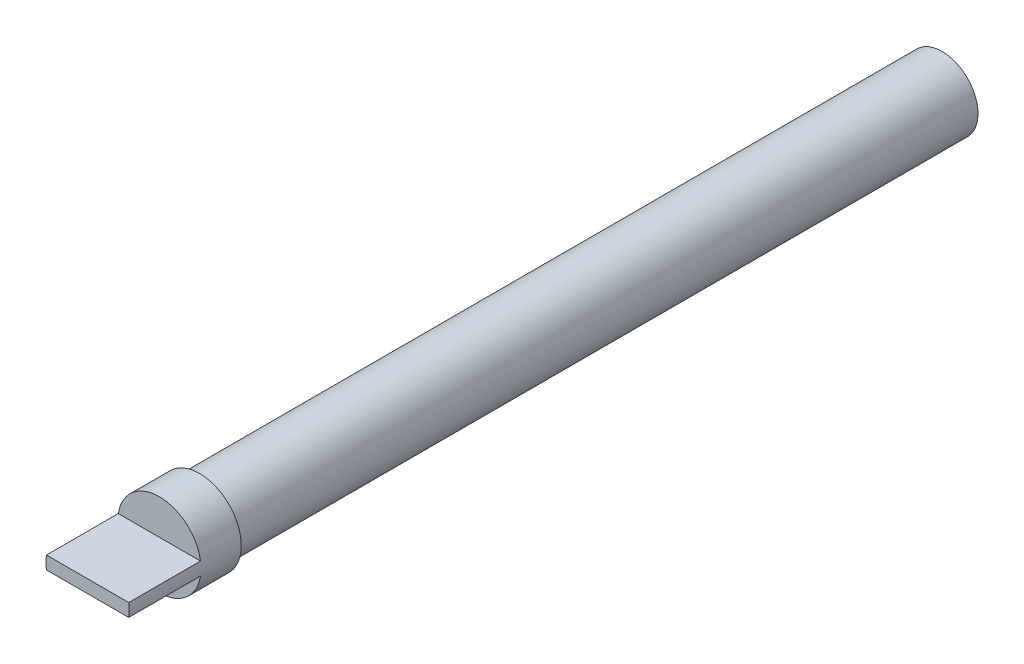
ISO-10303-21;
HEADER;
FILE_DESCRIPTION(('STEP AP214'),'2;1');
FILE_NAME('part.step','',(''),(''),'','','');
FILE_SCHEMA(('AUTOMOTIVE_DESIGN { 1 0 10303 214 1 1 1 1 }'));
ENDSEC;
DATA;
#1=APPLICATION_CONTEXT('core data for automotive mechanical design processes');
#2=APPLICATION_PROTOCOL_DEFINITION('international standard','automotive_design',2000,#1);
#3=PRODUCT_CONTEXT('',#1,'mechanical');
#4=PRODUCT('Part','Part','',(#3));
#5=PRODUCT_RELATED_PRODUCT_CATEGORY('part','',(#4));
#6=PRODUCT_DEFINITION_FORMATION('','',#4);
#7=PRODUCT_DEFINITION_CONTEXT('part definition',#1,'design');
#8=PRODUCT_DEFINITION('design','',#6,#7);
#9=PRODUCT_DEFINITION_SHAPE('','',#8);
#10=(LENGTH_UNIT() NAMED_UNIT(*) SI_UNIT(.MILLI.,.METRE.));
#11=(NAMED_UNIT(*) PLANE_ANGLE_UNIT() SI_UNIT($,.RADIAN.));
#12=(NAMED_UNIT(*) SI_UNIT($,.STERADIAN.) SOLID_ANGLE_UNIT());
#13=UNCERTAINTY_MEASURE_WITH_UNIT(LENGTH_MEASURE(1.E-05),#10,'distance_accuracy_value','');
#14=(GEOMETRIC_REPRESENTATION_CONTEXT(3) GLOBAL_UNCERTAINTY_ASSIGNED_CONTEXT((#13)) GLOBAL_UNIT_ASSIGNED_CONTEXT((#10,
#11,#12)) REPRESENTATION_CONTEXT('',''));
#15=CARTESIAN_POINT('',(0.,0.,0.));
#16=DIRECTION('',(0.,0.,1.));
#17=DIRECTION('',(1.,0.,0.));
#18=AXIS2_PLACEMENT_3D('',#15,#16,#17);
#19=CARTESIAN_POINT('',(0.,0.,7.8));
#20=DIRECTION('',(0.,0.,-1.));
#21=DIRECTION('',(-1.,0.,0.));
#22=AXIS2_PLACEMENT_3D('',#19,#20,#21);
#23=CYLINDRICAL_SURFACE('',#22,2.9);
#24=CARTESIAN_POINT('',(0.,0.,2.8));
#25=DIRECTION('',(0.,0.,-1.));
#26=DIRECTION('',(-1.,0.,0.));
#27=AXIS2_PLACEMENT_3D('',#24,#25,#26);
#28=CIRCLE('',#27,2.9);
#29=CARTESIAN_POINT('',(2.86487347015536,-0.45,2.8));
#30=VERTEX_POINT('',#29);
#31=CARTESIAN_POINT('',(-2.86487347015536,-0.45,2.8));
#32=VERTEX_POINT('',#31);
#33=EDGE_CURVE('E39',#30,#32,#28,.T.);
#34=ORIENTED_EDGE('',*,*,#33,.T.);
#35=DIRECTION('',(0.,0.,-1.));
#36=VECTOR('',#35,1.);
#37=CARTESIAN_POINT('',(-2.86487347015536,-0.45,7.8));
#38=LINE('',#37,#36);
#39=CARTESIAN_POINT('',(-2.86487347015536,-0.45,7.8));
#40=VERTEX_POINT('',#39);
#41=EDGE_CURVE('E100',#32,#40,#38,.F.);
#42=ORIENTED_EDGE('',*,*,#41,.T.);
#43=CARTESIAN_POINT('',(0.,0.,7.8));
#44=DIRECTION('',(0.,0.,1.));
#45=DIRECTION('',(1.,0.,0.));
#46=AXIS2_PLACEMENT_3D('',#43,#44,#45);
#47=CIRCLE('',#46,2.9);
#48=CARTESIAN_POINT('',(-2.86487347015536,0.45,7.8));
#49=VERTEX_POINT('',#48);
#50=EDGE_CURVE('E111',#49,#40,#47,.T.);
#51=ORIENTED_EDGE('',*,*,#50,.F.);
#52=DIRECTION('',(0.,0.,-1.));
#53=VECTOR('',#52,1.);
#54=CARTESIAN_POINT('',(-2.86487347015536,0.45,7.8));
#55=LINE('',#54,#53);
#56=CARTESIAN_POINT('',(-2.86487347015536,0.45,2.8));
#57=VERTEX_POINT('',#56);
#58=EDGE_CURVE('E54',#49,#57,#55,.T.);
#59=ORIENTED_EDGE('',*,*,#58,.T.);
#60=CARTESIAN_POINT('',(0.,0.,2.8));
#61=DIRECTION('',(0.,0.,1.));
#62=DIRECTION('',(1.,0.,0.));
#63=AXIS2_PLACEMENT_3D('',#60,#61,#62);
#64=CIRCLE('',#63,2.9);
#65=CARTESIAN_POINT('',(2.86487347015536,0.45,2.8));
#66=VERTEX_POINT('',#65);
#67=EDGE_CURVE('E119',#66,#57,#64,.T.);
#68=ORIENTED_EDGE('',*,*,#67,.F.);
#69=DIRECTION('',(0.,0.,1.));
#70=VECTOR('',#69,1.);
#71=CARTESIAN_POINT('',(2.86487347015536,0.45,2.8));
#72=LINE('',#71,#70);
#73=CARTESIAN_POINT('',(2.86487347015536,0.45,7.8));
#74=VERTEX_POINT('',#73);
#75=EDGE_CURVE('E106',#66,#74,#72,.T.);
#76=ORIENTED_EDGE('',*,*,#75,.T.);
#77=CARTESIAN_POINT('',(2.86487347015536,-0.45,7.8));
#78=VERTEX_POINT('',#77);
#79=EDGE_CURVE('E115',#78,#74,#47,.T.);
#80=ORIENTED_EDGE('',*,*,#79,.F.);
#81=DIRECTION('',(0.,0.,1.));
#82=VECTOR('',#81,1.);
#83=CARTESIAN_POINT('',(2.86487347015536,-0.45,2.8));
#84=LINE('',#83,#82);
#85=EDGE_CURVE('E46',#30,#78,#84,.T.);
#86=ORIENTED_EDGE('',*,*,#85,.F.);
#87=EDGE_LOOP('',(#34,#42,#51,#59,#68,#76,#80,#86));
#88=FACE_BOUND('',#87,.T.);
#89=CARTESIAN_POINT('',(0.,0.,0.));
#90=DIRECTION('',(0.,0.,1.));
#91=DIRECTION('',(1.,0.,0.));
#92=AXIS2_PLACEMENT_3D('',#89,#90,#91);
#93=CIRCLE('',#92,2.9);
#94=CARTESIAN_POINT('',(2.9,0.,0.));
#95=VERTEX_POINT('',#94);
#96=EDGE_CURVE('E110',#95,#95,#93,.T.);
#97=ORIENTED_EDGE('',*,*,#96,.T.);
#98=EDGE_LOOP('',(#97));
#99=FACE_BOUND('',#98,.T.);
#100=ADVANCED_FACE('F32',(#88,#99),#23,.T.);
#101=CARTESIAN_POINT('',(0.,0.,7.8));
#102=DIRECTION('',(0.,0.,1.));
#103=DIRECTION('',(1.,0.,0.));
#104=AXIS2_PLACEMENT_3D('',#101,#102,#103);
#105=PLANE('',#104);
#106=DIRECTION('',(-1.,0.,0.));
#107=VECTOR('',#106,1.);
#108=CARTESIAN_POINT('',(0.,-0.45,7.8));
#109=LINE('',#108,#107);
#110=EDGE_CURVE('E90',#78,#40,#109,.T.);
#111=ORIENTED_EDGE('',*,*,#110,.F.);
#112=ORIENTED_EDGE('',*,*,#79,.T.);
#113=DIRECTION('',(1.,0.,0.));
#114=VECTOR('',#113,1.);
#115=CARTESIAN_POINT('',(0.,0.45,7.8));
#116=LINE('',#115,#114);
#117=EDGE_CURVE('E114',#49,#74,#116,.T.);
#118=ORIENTED_EDGE('',*,*,#117,.F.);
#119=ORIENTED_EDGE('',*,*,#50,.T.);
#120=EDGE_LOOP('',(#111,#112,#118,#119));
#121=FACE_BOUND('',#120,.T.);
#122=ADVANCED_FACE('F129',(#121),#105,.T.);
#123=CARTESIAN_POINT('',(0.,0.,0.));
#124=DIRECTION('',(0.,0.,1.));
#125=DIRECTION('',(1.,0.,0.));
#126=AXIS2_PLACEMENT_3D('',#123,#124,#125);
#127=PLANE('',#126);
#128=CARTESIAN_POINT('',(0.,0.,0.));
#129=DIRECTION('',(0.,0.,1.));
#130=DIRECTION('',(1.,0.,0.));
#131=AXIS2_PLACEMENT_3D('',#128,#129,#130);
#132=CIRCLE('',#131,2.5);
#133=CARTESIAN_POINT('',(2.5,0.,0.));
#134=VERTEX_POINT('',#133);
#135=EDGE_CURVE('E11',#134,#134,#132,.F.);
#136=ORIENTED_EDGE('',*,*,#135,.F.);
#137=EDGE_LOOP('',(#136));
#138=FACE_BOUND('',#137,.T.);
#139=ORIENTED_EDGE('',*,*,#96,.F.);
#140=EDGE_LOOP('',(#139));
#141=FACE_BOUND('',#140,.T.);
#142=ADVANCED_FACE('F135',(#138,#141),#127,.F.);
#143=CARTESIAN_POINT('',(0.,0.,2.8));
#144=DIRECTION('',(0.,0.,1.));
#145=DIRECTION('',(1.,0.,0.));
#146=AXIS2_PLACEMENT_3D('',#143,#144,#145);
#147=PLANE('',#146);
#148=DIRECTION('',(1.,0.,0.));
#149=VECTOR('',#148,1.);
#150=CARTESIAN_POINT('',(-3.30556326563076,0.45,2.8));
#151=LINE('',#150,#149);
#152=EDGE_CURVE('E103',#57,#66,#151,.T.);
#153=ORIENTED_EDGE('',*,*,#152,.T.);
#154=ORIENTED_EDGE('',*,*,#67,.T.);
#155=EDGE_LOOP('',(#153,#154));
#156=FACE_BOUND('',#155,.T.);
#157=ADVANCED_FACE('F133',(#156),#147,.T.);
#158=CARTESIAN_POINT('',(0.,0.45,2.8));
#159=DIRECTION('',(0.,-1.,0.));
#160=DIRECTION('',(0.,0.,-1.));
#161=AXIS2_PLACEMENT_3D('',#158,#159,#160);
#162=PLANE('',#161);
#163=ORIENTED_EDGE('',*,*,#117,.T.);
#164=ORIENTED_EDGE('',*,*,#75,.F.);
#165=ORIENTED_EDGE('',*,*,#152,.F.);
#166=ORIENTED_EDGE('',*,*,#58,.F.);
#167=EDGE_LOOP('',(#163,#164,#165,#166));
#168=FACE_BOUND('',#167,.T.);
#169=ADVANCED_FACE('F131',(#168),#162,.F.);
#170=CARTESIAN_POINT('',(0.,0.,2.8));
#171=DIRECTION('',(0.,0.,-1.));
#172=DIRECTION('',(-1.,0.,0.));
#173=AXIS2_PLACEMENT_3D('',#170,#171,#172);
#174=PLANE('',#173);
#175=DIRECTION('',(-1.,0.,0.));
#176=VECTOR('',#175,1.);
#177=CARTESIAN_POINT('',(-2.9,-0.45,2.8));
#178=LINE('',#177,#176);
#179=EDGE_CURVE('E95',#30,#32,#178,.T.);
#180=ORIENTED_EDGE('',*,*,#179,.T.);
#181=ORIENTED_EDGE('',*,*,#33,.F.);
#182=EDGE_LOOP('',(#180,#181));
#183=FACE_BOUND('',#182,.T.);
#184=ADVANCED_FACE('F126',(#183),#174,.F.);
#185=CARTESIAN_POINT('',(0.,-0.45,2.8));
#186=DIRECTION('',(0.,1.,0.));
#187=DIRECTION('',(0.,0.,1.));
#188=AXIS2_PLACEMENT_3D('',#185,#186,#187);
#189=PLANE('',#188);
#190=ORIENTED_EDGE('',*,*,#179,.F.);
#191=ORIENTED_EDGE('',*,*,#85,.T.);
#192=ORIENTED_EDGE('',*,*,#110,.T.);
#193=ORIENTED_EDGE('',*,*,#41,.F.);
#194=EDGE_LOOP('',(#190,#191,#192,#193));
#195=FACE_BOUND('',#194,.T.);
#196=ADVANCED_FACE('F127',(#195),#189,.F.);
#197=CARTESIAN_POINT('',(0.,0.,-51.7));
#198=DIRECTION('',(0.,0.,1.));
#199=DIRECTION('',(1.,0.,0.));
#200=AXIS2_PLACEMENT_3D('',#197,#198,#199);
#201=CYLINDRICAL_SURFACE('',#200,2.5);
#202=CARTESIAN_POINT('',(0.,0.,-51.7));
#203=DIRECTION('',(0.,0.,-1.));
#204=DIRECTION('',(-1.,0.,0.));
#205=AXIS2_PLACEMENT_3D('',#202,#203,#204);
#206=CIRCLE('',#205,2.5);
#207=CARTESIAN_POINT('',(-2.5,0.,-51.7));
#208=VERTEX_POINT('',#207);
#209=EDGE_CURVE('E86',#208,#208,#206,.T.);
#210=ORIENTED_EDGE('',*,*,#209,.F.);
#211=EDGE_LOOP('',(#210));
#212=FACE_BOUND('',#211,.T.);
#213=ORIENTED_EDGE('',*,*,#135,.T.);
#214=EDGE_LOOP('',(#213));
#215=FACE_BOUND('',#214,.T.);
#216=ADVANCED_FACE('F166',(#212,#215),#201,.T.);
#217=CARTESIAN_POINT('',(0.,0.,-51.7));
#218=DIRECTION('',(0.,0.,-1.));
#219=DIRECTION('',(-1.,0.,0.));
#220=AXIS2_PLACEMENT_3D('',#217,#218,#219);
#221=PLANE('',#220);
#222=CARTESIAN_POINT('',(0.,0.,-51.7));
#223=DIRECTION('',(0.,0.,-1.));
#224=DIRECTION('',(-1.,0.,0.));
#225=AXIS2_PLACEMENT_3D('',#222,#223,#224);
#226=CIRCLE('',#225,1.74999999999999);
#227=CARTESIAN_POINT('',(-1.74999999999999,0.,-51.7));
#228=VERTEX_POINT('',#227);
#229=EDGE_CURVE('E87',#228,#228,#226,.T.);
#230=ORIENTED_EDGE('',*,*,#229,.F.);
#231=EDGE_LOOP('',(#230));
#232=FACE_BOUND('',#231,.T.);
#233=ORIENTED_EDGE('',*,*,#209,.T.);
#234=EDGE_LOOP('',(#233));
#235=FACE_BOUND('',#234,.T.);
#236=ADVANCED_FACE('F80',(#232,#235),#221,.T.);
#237=CARTESIAN_POINT('',(0.,0.,-34.7));
#238=DIRECTION('',(0.,0.,-1.));
#239=DIRECTION('',(-1.,0.,0.));
#240=AXIS2_PLACEMENT_3D('',#237,#238,#239);
#241=CONICAL_SURFACE('',#240,1.75,1.02974425867665);
#242=CARTESIAN_POINT('',(0.,0.,-33.6484939167018));
#243=VERTEX_POINT('',#242);
#244=VERTEX_LOOP('',#243);
#245=FACE_BOUND('',#244,.T.);
#246=CARTESIAN_POINT('',(0.,0.,-34.7));
#247=DIRECTION('',(0.,0.,-1.));
#248=DIRECTION('',(-1.,0.,0.));
#249=AXIS2_PLACEMENT_3D('',#246,#247,#248);
#250=CIRCLE('',#249,1.75);
#251=CARTESIAN_POINT('',(-1.75,0.,-34.7));
#252=VERTEX_POINT('',#251);
#253=EDGE_CURVE('E84',#252,#252,#250,.T.);
#254=ORIENTED_EDGE('',*,*,#253,.T.);
#255=EDGE_LOOP('',(#254));
#256=FACE_BOUND('',#255,.T.);
#257=ADVANCED_FACE('F76',(#245,#256),#241,.F.);
#258=CARTESIAN_POINT('',(0.,0.,-51.7));
#259=DIRECTION('',(0.,0.,-1.));
#260=DIRECTION('',(-1.,0.,0.));
#261=AXIS2_PLACEMENT_3D('',#258,#259,#260);
#262=CYLINDRICAL_SURFACE('',#261,1.74999999999999);
#263=ORIENTED_EDGE('',*,*,#253,.F.);
#264=EDGE_LOOP('',(#263));
#265=FACE_BOUND('',#264,.T.);
#266=ORIENTED_EDGE('',*,*,#229,.T.);
#267=EDGE_LOOP('',(#266));
#268=FACE_BOUND('',#267,.T.);
#269=ADVANCED_FACE('F79',(#265,#268),#262,.F.);
#270=CLOSED_SHELL('',(#100,#122,#142,#157,#169,#184,#196,#216,#236,#257,#269));
#271=MANIFOLD_SOLID_BREP('B2',#270);
#272=ADVANCED_BREP_SHAPE_REPRESENTATION('',(#18,#271),#14);
#273=SHAPE_DEFINITION_REPRESENTATION(#9,#272);
ENDSEC;
END-ISO-10303-21;
